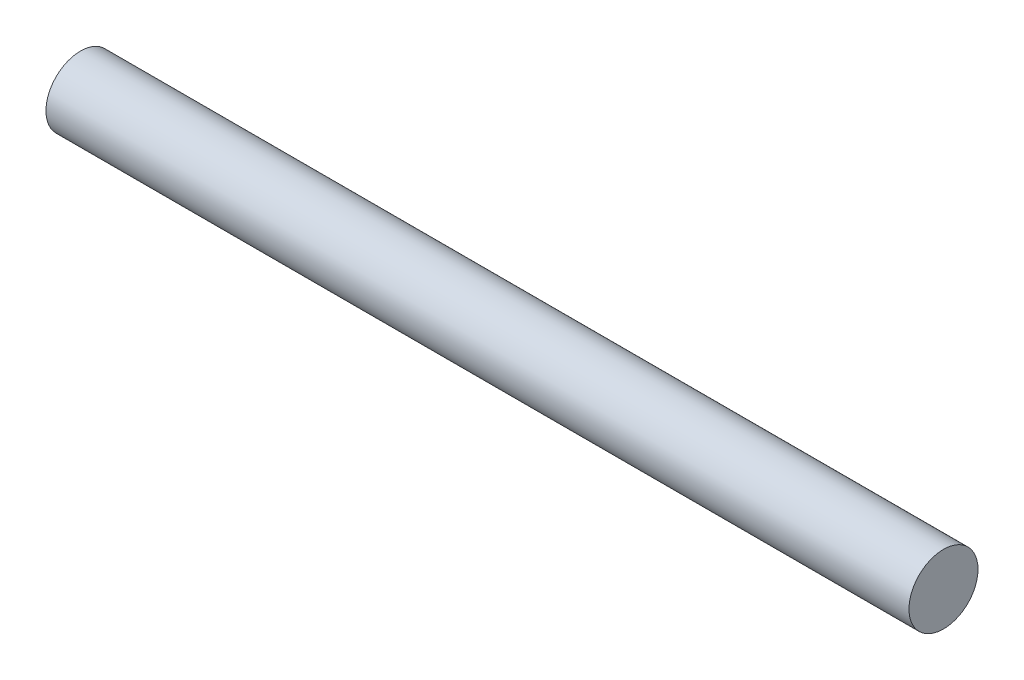
ISO-10303-21;
HEADER;
FILE_DESCRIPTION(('STEP AP214'),'2;1');
FILE_NAME('part.step','',(''),(''),'','','');
FILE_SCHEMA(('AUTOMOTIVE_DESIGN { 1 0 10303 214 1 1 1 1 }'));
ENDSEC;
DATA;
#1=APPLICATION_CONTEXT('core data for automotive mechanical design processes');
#2=APPLICATION_PROTOCOL_DEFINITION('international standard','automotive_design',2000,#1);
#3=PRODUCT_CONTEXT('',#1,'mechanical');
#4=PRODUCT('Part','Part','',(#3));
#5=PRODUCT_RELATED_PRODUCT_CATEGORY('part','',(#4));
#6=PRODUCT_DEFINITION_FORMATION('','',#4);
#7=PRODUCT_DEFINITION_CONTEXT('part definition',#1,'design');
#8=PRODUCT_DEFINITION('design','',#6,#7);
#9=PRODUCT_DEFINITION_SHAPE('','',#8);
#10=(LENGTH_UNIT() NAMED_UNIT(*) SI_UNIT(.MILLI.,.METRE.));
#11=(NAMED_UNIT(*) PLANE_ANGLE_UNIT() SI_UNIT($,.RADIAN.));
#12=(NAMED_UNIT(*) SI_UNIT($,.STERADIAN.) SOLID_ANGLE_UNIT());
#13=UNCERTAINTY_MEASURE_WITH_UNIT(LENGTH_MEASURE(1.E-05),#10,'distance_accuracy_value','');
#14=(GEOMETRIC_REPRESENTATION_CONTEXT(3) GLOBAL_UNCERTAINTY_ASSIGNED_CONTEXT((#13)) GLOBAL_UNIT_ASSIGNED_CONTEXT((#10,
#11,#12)) REPRESENTATION_CONTEXT('',''));
#15=CARTESIAN_POINT('',(0.,0.,0.));
#16=DIRECTION('',(0.,0.,1.));
#17=DIRECTION('',(1.,0.,0.));
#18=AXIS2_PLACEMENT_3D('',#15,#16,#17);
#19=CARTESIAN_POINT('',(100.,0.,0.));
#20=DIRECTION('',(-1.,0.,0.));
#21=DIRECTION('',(0.,0.,1.));
#22=AXIS2_PLACEMENT_3D('',#19,#20,#21);
#23=CYLINDRICAL_SURFACE('',#22,4.);
#24=CARTESIAN_POINT('',(100.,0.,0.));
#25=DIRECTION('',(1.,0.,0.));
#26=DIRECTION('',(0.,0.,-1.));
#27=AXIS2_PLACEMENT_3D('',#24,#25,#26);
#28=CIRCLE('',#27,4.);
#29=CARTESIAN_POINT('',(100.,0.,-4.));
#30=VERTEX_POINT('',#29);
#31=EDGE_CURVE('E10',#30,#30,#28,.T.);
#32=ORIENTED_EDGE('',*,*,#31,.F.);
#33=EDGE_LOOP('',(#32));
#34=FACE_BOUND('',#33,.T.);
#35=CARTESIAN_POINT('',(0.,0.,0.));
#36=DIRECTION('',(1.,0.,0.));
#37=DIRECTION('',(0.,0.,-1.));
#38=AXIS2_PLACEMENT_3D('',#35,#36,#37);
#39=CIRCLE('',#38,4.);
#40=CARTESIAN_POINT('',(0.,0.,-4.));
#41=VERTEX_POINT('',#40);
#42=EDGE_CURVE('E40',#41,#41,#39,.T.);
#43=ORIENTED_EDGE('',*,*,#42,.T.);
#44=EDGE_LOOP('',(#43));
#45=FACE_BOUND('',#44,.T.);
#46=ADVANCED_FACE('F37',(#34,#45),#23,.T.);
#47=CARTESIAN_POINT('',(100.,0.,0.));
#48=DIRECTION('',(1.,0.,0.));
#49=DIRECTION('',(0.,0.,-1.));
#50=AXIS2_PLACEMENT_3D('',#47,#48,#49);
#51=PLANE('',#50);
#52=ORIENTED_EDGE('',*,*,#31,.T.);
#53=EDGE_LOOP('',(#52));
#54=FACE_BOUND('',#53,.T.);
#55=ADVANCED_FACE('F52',(#54),#51,.T.);
#56=CARTESIAN_POINT('',(0.,0.,0.));
#57=DIRECTION('',(1.,0.,0.));
#58=DIRECTION('',(0.,0.,-1.));
#59=AXIS2_PLACEMENT_3D('',#56,#57,#58);
#60=PLANE('',#59);
#61=ORIENTED_EDGE('',*,*,#42,.F.);
#62=EDGE_LOOP('',(#61));
#63=FACE_BOUND('',#62,.T.);
#64=ADVANCED_FACE('F50',(#63),#60,.F.);
#65=CLOSED_SHELL('',(#46,#55,#64));
#66=MANIFOLD_SOLID_BREP('B2',#65);
#67=ADVANCED_BREP_SHAPE_REPRESENTATION('',(#18,#66),#14);
#68=SHAPE_DEFINITION_REPRESENTATION(#9,#67);
ENDSEC;
END-ISO-10303-21;
